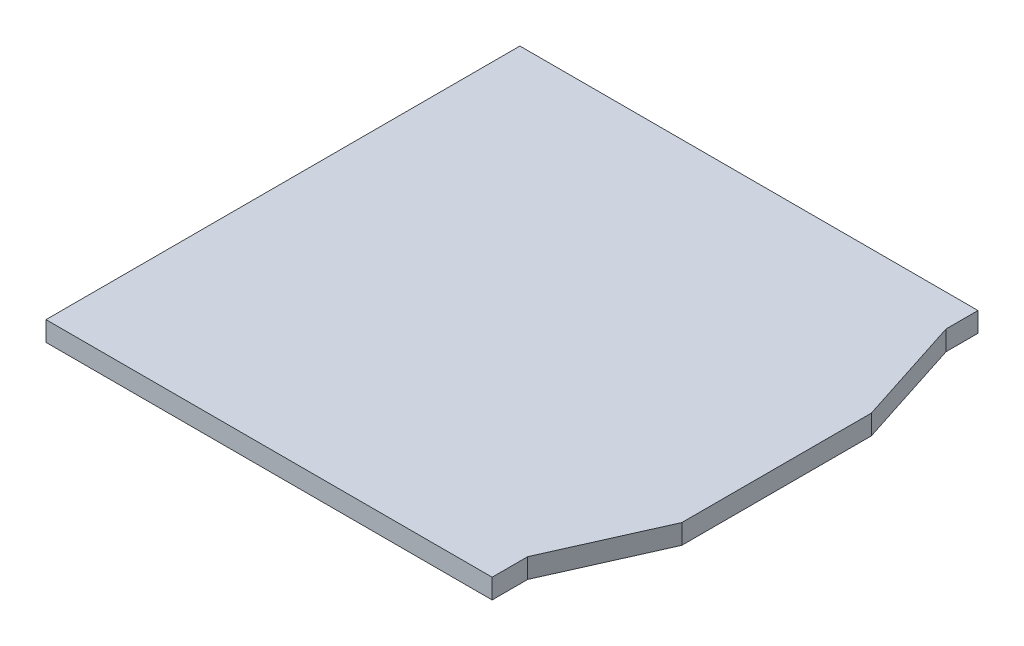
ISO-10303-21;
HEADER;
FILE_DESCRIPTION(('STEP AP214'),'2;1');
FILE_NAME('part.step','',(''),(''),'','','');
FILE_SCHEMA(('AUTOMOTIVE_DESIGN { 1 0 10303 214 1 1 1 1 }'));
ENDSEC;
DATA;
#1=APPLICATION_CONTEXT('core data for automotive mechanical design processes');
#2=APPLICATION_PROTOCOL_DEFINITION('international standard','automotive_design',2000,#1);
#3=PRODUCT_CONTEXT('',#1,'mechanical');
#4=PRODUCT('Part','Part','',(#3));
#5=PRODUCT_RELATED_PRODUCT_CATEGORY('part','',(#4));
#6=PRODUCT_DEFINITION_FORMATION('','',#4);
#7=PRODUCT_DEFINITION_CONTEXT('part definition',#1,'design');
#8=PRODUCT_DEFINITION('design','',#6,#7);
#9=PRODUCT_DEFINITION_SHAPE('','',#8);
#10=(LENGTH_UNIT() NAMED_UNIT(*) SI_UNIT(.MILLI.,.METRE.));
#11=(NAMED_UNIT(*) PLANE_ANGLE_UNIT() SI_UNIT($,.RADIAN.));
#12=(NAMED_UNIT(*) SI_UNIT($,.STERADIAN.) SOLID_ANGLE_UNIT());
#13=UNCERTAINTY_MEASURE_WITH_UNIT(LENGTH_MEASURE(1.E-05),#10,'distance_accuracy_value','');
#14=(GEOMETRIC_REPRESENTATION_CONTEXT(3) GLOBAL_UNCERTAINTY_ASSIGNED_CONTEXT((#13)) GLOBAL_UNIT_ASSIGNED_CONTEXT((#10,
#11,#12)) REPRESENTATION_CONTEXT('',''));
#15=CARTESIAN_POINT('',(0.,0.,0.));
#16=DIRECTION('',(0.,0.,1.));
#17=DIRECTION('',(1.,0.,0.));
#18=AXIS2_PLACEMENT_3D('',#15,#16,#17);
#19=CARTESIAN_POINT('',(2.67500000000001,0.25,-2.59567393075599));
#20=DIRECTION('',(0.951751923424657,0.,-0.306868499943325));
#21=DIRECTION('',(-0.306868499943325,0.,-0.951751923424657));
#22=AXIS2_PLACEMENT_3D('',#19,#20,#21);
#23=PLANE('',#22);
#24=DIRECTION('',(0.306868499943325,0.,0.951751923424657));
#25=VECTOR('',#24,1.);
#26=CARTESIAN_POINT('',(2.67500000000001,0.,-2.59567393075599));
#27=LINE('',#26,#25);
#28=CARTESIAN_POINT('',(2.67500000000001,0.,-2.59567393075599));
#29=VERTEX_POINT('',#28);
#30=CARTESIAN_POINT('',(3.12500000000001,0.,-1.2));
#31=VERTEX_POINT('',#30);
#32=EDGE_CURVE('E130',#29,#31,#27,.T.);
#33=ORIENTED_EDGE('',*,*,#32,.F.);
#34=DIRECTION('',(0.,-1.,0.));
#35=VECTOR('',#34,1.);
#36=CARTESIAN_POINT('',(2.67500000000001,0.25,-2.59567393075599));
#37=LINE('',#36,#35);
#38=CARTESIAN_POINT('',(2.67500000000001,0.25,-2.59567393075599));
#39=VERTEX_POINT('',#38);
#40=EDGE_CURVE('E11',#39,#29,#37,.T.);
#41=ORIENTED_EDGE('',*,*,#40,.F.);
#42=DIRECTION('',(0.306868499943325,0.,0.951751923424657));
#43=VECTOR('',#42,1.);
#44=CARTESIAN_POINT('',(2.67500000000001,0.25,-2.59567393075599));
#45=LINE('',#44,#43);
#46=CARTESIAN_POINT('',(3.12500000000001,0.25,-1.2));
#47=VERTEX_POINT('',#46);
#48=EDGE_CURVE('E148',#39,#47,#45,.T.);
#49=ORIENTED_EDGE('',*,*,#48,.T.);
#50=DIRECTION('',(0.,-1.,0.));
#51=VECTOR('',#50,1.);
#52=CARTESIAN_POINT('',(3.12500000000001,0.25,-1.2));
#53=LINE('',#52,#51);
#54=EDGE_CURVE('E39',#47,#31,#53,.T.);
#55=ORIENTED_EDGE('',*,*,#54,.T.);
#56=EDGE_LOOP('',(#33,#41,#49,#55));
#57=FACE_BOUND('',#56,.T.);
#58=ADVANCED_FACE('F36',(#57),#23,.T.);
#59=CARTESIAN_POINT('',(2.67500000000001,0.25,-3.));
#60=DIRECTION('',(1.,0.,0.));
#61=DIRECTION('',(0.,0.,-1.));
#62=AXIS2_PLACEMENT_3D('',#59,#60,#61);
#63=PLANE('',#62);
#64=DIRECTION('',(0.,0.,1.));
#65=VECTOR('',#64,1.);
#66=CARTESIAN_POINT('',(2.67500000000001,0.,-3.));
#67=LINE('',#66,#65);
#68=CARTESIAN_POINT('',(2.67500000000001,0.,-3.));
#69=VERTEX_POINT('',#68);
#70=EDGE_CURVE('E146',#69,#29,#67,.T.);
#71=ORIENTED_EDGE('',*,*,#70,.F.);
#72=DIRECTION('',(0.,-1.,0.));
#73=VECTOR('',#72,1.);
#74=CARTESIAN_POINT('',(2.67500000000001,0.25,-3.));
#75=LINE('',#74,#73);
#76=CARTESIAN_POINT('',(2.67500000000001,0.25,-3.));
#77=VERTEX_POINT('',#76);
#78=EDGE_CURVE('E45',#77,#69,#75,.T.);
#79=ORIENTED_EDGE('',*,*,#78,.F.);
#80=DIRECTION('',(0.,0.,1.));
#81=VECTOR('',#80,1.);
#82=CARTESIAN_POINT('',(2.67500000000001,0.25,-3.));
#83=LINE('',#82,#81);
#84=EDGE_CURVE('E125',#77,#39,#83,.T.);
#85=ORIENTED_EDGE('',*,*,#84,.T.);
#86=ORIENTED_EDGE('',*,*,#40,.T.);
#87=EDGE_LOOP('',(#71,#79,#85,#86));
#88=FACE_BOUND('',#87,.T.);
#89=ADVANCED_FACE('F163',(#88),#63,.T.);
#90=CARTESIAN_POINT('',(-3.12500000000001,0.25,-3.));
#91=DIRECTION('',(0.,0.,-1.));
#92=DIRECTION('',(-1.,0.,0.));
#93=AXIS2_PLACEMENT_3D('',#90,#91,#92);
#94=PLANE('',#93);
#95=DIRECTION('',(1.,0.,0.));
#96=VECTOR('',#95,1.);
#97=CARTESIAN_POINT('',(-3.12500000000001,0.,-3.));
#98=LINE('',#97,#96);
#99=CARTESIAN_POINT('',(-3.12500000000001,0.,-3.));
#100=VERTEX_POINT('',#99);
#101=EDGE_CURVE('E111',#100,#69,#98,.T.);
#102=ORIENTED_EDGE('',*,*,#101,.F.);
#103=DIRECTION('',(0.,-1.,0.));
#104=VECTOR('',#103,1.);
#105=CARTESIAN_POINT('',(-3.12500000000001,0.25,-3.));
#106=LINE('',#105,#104);
#107=CARTESIAN_POINT('',(-3.12500000000001,0.25,-3.));
#108=VERTEX_POINT('',#107);
#109=EDGE_CURVE('E105',#108,#100,#106,.T.);
#110=ORIENTED_EDGE('',*,*,#109,.F.);
#111=DIRECTION('',(1.,0.,0.));
#112=VECTOR('',#111,1.);
#113=CARTESIAN_POINT('',(-3.12500000000001,0.25,-3.));
#114=LINE('',#113,#112);
#115=EDGE_CURVE('E109',#108,#77,#114,.T.);
#116=ORIENTED_EDGE('',*,*,#115,.T.);
#117=ORIENTED_EDGE('',*,*,#78,.T.);
#118=EDGE_LOOP('',(#102,#110,#116,#117));
#119=FACE_BOUND('',#118,.T.);
#120=ADVANCED_FACE('F107',(#119),#94,.T.);
#121=CARTESIAN_POINT('',(-3.12500000000001,0.25,-3.));
#122=DIRECTION('',(1.,0.,0.));
#123=DIRECTION('',(0.,0.,-1.));
#124=AXIS2_PLACEMENT_3D('',#121,#122,#123);
#125=PLANE('',#124);
#126=DIRECTION('',(0.,0.,1.));
#127=VECTOR('',#126,1.);
#128=CARTESIAN_POINT('',(-3.12500000000001,0.,-3.));
#129=LINE('',#128,#127);
#130=CARTESIAN_POINT('',(-3.12500000000001,0.,3.));
#131=VERTEX_POINT('',#130);
#132=EDGE_CURVE('E143',#100,#131,#129,.T.);
#133=ORIENTED_EDGE('',*,*,#132,.T.);
#134=DIRECTION('',(0.,-1.,0.));
#135=VECTOR('',#134,1.);
#136=CARTESIAN_POINT('',(-3.12500000000001,0.25,3.));
#137=LINE('',#136,#135);
#138=CARTESIAN_POINT('',(-3.12500000000001,0.25,3.));
#139=VERTEX_POINT('',#138);
#140=EDGE_CURVE('E114',#139,#131,#137,.T.);
#141=ORIENTED_EDGE('',*,*,#140,.F.);
#142=DIRECTION('',(0.,0.,1.));
#143=VECTOR('',#142,1.);
#144=CARTESIAN_POINT('',(-3.12500000000001,0.25,-3.));
#145=LINE('',#144,#143);
#146=EDGE_CURVE('E117',#108,#139,#145,.T.);
#147=ORIENTED_EDGE('',*,*,#146,.F.);
#148=ORIENTED_EDGE('',*,*,#109,.T.);
#149=EDGE_LOOP('',(#133,#141,#147,#148));
#150=FACE_BOUND('',#149,.T.);
#151=ADVANCED_FACE('F118',(#150),#125,.F.);
#152=CARTESIAN_POINT('',(-3.12500000000001,0.25,3.));
#153=DIRECTION('',(0.,0.,-1.));
#154=DIRECTION('',(-1.,0.,0.));
#155=AXIS2_PLACEMENT_3D('',#152,#153,#154);
#156=PLANE('',#155);
#157=DIRECTION('',(1.,0.,0.));
#158=VECTOR('',#157,1.);
#159=CARTESIAN_POINT('',(-3.12500000000001,0.,3.));
#160=LINE('',#159,#158);
#161=CARTESIAN_POINT('',(2.52346616061949,0.,3.));
#162=VERTEX_POINT('',#161);
#163=EDGE_CURVE('E141',#131,#162,#160,.T.);
#164=ORIENTED_EDGE('',*,*,#163,.T.);
#165=DIRECTION('',(0.,-1.,0.));
#166=VECTOR('',#165,1.);
#167=CARTESIAN_POINT('',(2.52346616061949,0.25,3.));
#168=LINE('',#167,#166);
#169=CARTESIAN_POINT('',(2.52346616061949,0.25,3.));
#170=VERTEX_POINT('',#169);
#171=EDGE_CURVE('E152',#170,#162,#168,.T.);
#172=ORIENTED_EDGE('',*,*,#171,.F.);
#173=DIRECTION('',(1.,0.,0.));
#174=VECTOR('',#173,1.);
#175=CARTESIAN_POINT('',(-3.12500000000001,0.25,3.));
#176=LINE('',#175,#174);
#177=EDGE_CURVE('E122',#139,#170,#176,.T.);
#178=ORIENTED_EDGE('',*,*,#177,.F.);
#179=ORIENTED_EDGE('',*,*,#140,.T.);
#180=EDGE_LOOP('',(#164,#172,#178,#179));
#181=FACE_BOUND('',#180,.T.);
#182=ADVANCED_FACE('F176',(#181),#156,.F.);
#183=CARTESIAN_POINT('',(2.52346616061949,0.25,3.));
#184=DIRECTION('',(-1.,0.,0.));
#185=DIRECTION('',(0.,0.,1.));
#186=AXIS2_PLACEMENT_3D('',#183,#184,#185);
#187=PLANE('',#186);
#188=DIRECTION('',(0.,0.,-1.));
#189=VECTOR('',#188,1.);
#190=CARTESIAN_POINT('',(2.52346616061949,0.,3.));
#191=LINE('',#190,#189);
#192=CARTESIAN_POINT('',(2.52346616061949,0.,2.55));
#193=VERTEX_POINT('',#192);
#194=EDGE_CURVE('E139',#162,#193,#191,.T.);
#195=ORIENTED_EDGE('',*,*,#194,.T.);
#196=DIRECTION('',(0.,-1.,0.));
#197=VECTOR('',#196,1.);
#198=CARTESIAN_POINT('',(2.52346616061949,0.25,2.55));
#199=LINE('',#198,#197);
#200=CARTESIAN_POINT('',(2.52346616061949,0.25,2.55));
#201=VERTEX_POINT('',#200);
#202=EDGE_CURVE('E155',#201,#193,#199,.T.);
#203=ORIENTED_EDGE('',*,*,#202,.F.);
#204=DIRECTION('',(0.,0.,-1.));
#205=VECTOR('',#204,1.);
#206=CARTESIAN_POINT('',(2.52346616061949,0.25,3.));
#207=LINE('',#206,#205);
#208=EDGE_CURVE('E254',#170,#201,#207,.T.);
#209=ORIENTED_EDGE('',*,*,#208,.F.);
#210=ORIENTED_EDGE('',*,*,#171,.T.);
#211=EDGE_LOOP('',(#195,#203,#209,#210));
#212=FACE_BOUND('',#211,.T.);
#213=ADVANCED_FACE('F179',(#212),#187,.F.);
#214=CARTESIAN_POINT('',(2.52346616061949,0.25,2.55));
#215=DIRECTION('',(-0.913425969645802,0.,-0.407004911489563));
#216=DIRECTION('',(-0.407004911489563,0.,0.913425969645802));
#217=AXIS2_PLACEMENT_3D('',#214,#215,#216);
#218=PLANE('',#217);
#219=DIRECTION('',(0.407004911489563,0.,-0.913425969645802));
#220=VECTOR('',#219,1.);
#221=CARTESIAN_POINT('',(2.52346616061949,0.,2.55));
#222=LINE('',#221,#220);
#223=CARTESIAN_POINT('',(3.12500000000001,0.,1.2));
#224=VERTEX_POINT('',#223);
#225=EDGE_CURVE('E136',#193,#224,#222,.T.);
#226=ORIENTED_EDGE('',*,*,#225,.T.);
#227=DIRECTION('',(0.,-1.,0.));
#228=VECTOR('',#227,1.);
#229=CARTESIAN_POINT('',(3.12500000000001,0.25,1.2));
#230=LINE('',#229,#228);
#231=CARTESIAN_POINT('',(3.12500000000001,0.25,1.2));
#232=VERTEX_POINT('',#231);
#233=EDGE_CURVE('E157',#232,#224,#230,.T.);
#234=ORIENTED_EDGE('',*,*,#233,.F.);
#235=DIRECTION('',(0.407004911489563,0.,-0.913425969645802));
#236=VECTOR('',#235,1.);
#237=CARTESIAN_POINT('',(2.52346616061949,0.25,2.55));
#238=LINE('',#237,#236);
#239=EDGE_CURVE('E255',#201,#232,#238,.T.);
#240=ORIENTED_EDGE('',*,*,#239,.F.);
#241=ORIENTED_EDGE('',*,*,#202,.T.);
#242=EDGE_LOOP('',(#226,#234,#240,#241));
#243=FACE_BOUND('',#242,.T.);
#244=ADVANCED_FACE('F183',(#243),#218,.F.);
#245=CARTESIAN_POINT('',(3.12500000000001,0.25,-1.2));
#246=DIRECTION('',(1.,0.,0.));
#247=DIRECTION('',(0.,0.,-1.));
#248=AXIS2_PLACEMENT_3D('',#245,#246,#247);
#249=PLANE('',#248);
#250=DIRECTION('',(0.,0.,1.));
#251=VECTOR('',#250,1.);
#252=CARTESIAN_POINT('',(3.12500000000001,0.,-1.2));
#253=LINE('',#252,#251);
#254=EDGE_CURVE('E133',#31,#224,#253,.T.);
#255=ORIENTED_EDGE('',*,*,#254,.F.);
#256=ORIENTED_EDGE('',*,*,#54,.F.);
#257=DIRECTION('',(0.,0.,1.));
#258=VECTOR('',#257,1.);
#259=CARTESIAN_POINT('',(3.12500000000001,0.25,-1.2));
#260=LINE('',#259,#258);
#261=EDGE_CURVE('E259',#47,#232,#260,.T.);
#262=ORIENTED_EDGE('',*,*,#261,.T.);
#263=ORIENTED_EDGE('',*,*,#233,.T.);
#264=EDGE_LOOP('',(#255,#256,#262,#263));
#265=FACE_BOUND('',#264,.T.);
#266=ADVANCED_FACE('F159',(#265),#249,.T.);
#267=CARTESIAN_POINT('',(0.,0.25,0.));
#268=DIRECTION('',(0.,1.,0.));
#269=DIRECTION('',(0.,0.,1.));
#270=AXIS2_PLACEMENT_3D('',#267,#268,#269);
#271=PLANE('',#270);
#272=ORIENTED_EDGE('',*,*,#48,.F.);
#273=ORIENTED_EDGE('',*,*,#84,.F.);
#274=ORIENTED_EDGE('',*,*,#115,.F.);
#275=ORIENTED_EDGE('',*,*,#146,.T.);
#276=ORIENTED_EDGE('',*,*,#177,.T.);
#277=ORIENTED_EDGE('',*,*,#208,.T.);
#278=ORIENTED_EDGE('',*,*,#239,.T.);
#279=ORIENTED_EDGE('',*,*,#261,.F.);
#280=EDGE_LOOP('',(#272,#273,#274,#275,#276,#277,#278,#279));
#281=FACE_BOUND('',#280,.T.);
#282=ADVANCED_FACE('F124',(#281),#271,.T.);
#283=CARTESIAN_POINT('',(0.,0.,0.));
#284=DIRECTION('',(0.,1.,0.));
#285=DIRECTION('',(0.,0.,1.));
#286=AXIS2_PLACEMENT_3D('',#283,#284,#285);
#287=PLANE('',#286);
#288=ORIENTED_EDGE('',*,*,#32,.T.);
#289=ORIENTED_EDGE('',*,*,#254,.T.);
#290=ORIENTED_EDGE('',*,*,#225,.F.);
#291=ORIENTED_EDGE('',*,*,#194,.F.);
#292=ORIENTED_EDGE('',*,*,#163,.F.);
#293=ORIENTED_EDGE('',*,*,#132,.F.);
#294=ORIENTED_EDGE('',*,*,#101,.T.);
#295=ORIENTED_EDGE('',*,*,#70,.T.);
#296=EDGE_LOOP('',(#288,#289,#290,#291,#292,#293,#294,#295));
#297=FACE_BOUND('',#296,.T.);
#298=ADVANCED_FACE('F162',(#297),#287,.F.);
#299=CLOSED_SHELL('',(#58,#89,#120,#151,#182,#213,#244,#266,#282,#298));
#300=MANIFOLD_SOLID_BREP('B2',#299);
#301=ADVANCED_BREP_SHAPE_REPRESENTATION('',(#18,#300),#14);
#302=SHAPE_DEFINITION_REPRESENTATION(#9,#301);
ENDSEC;
END-ISO-10303-21;
